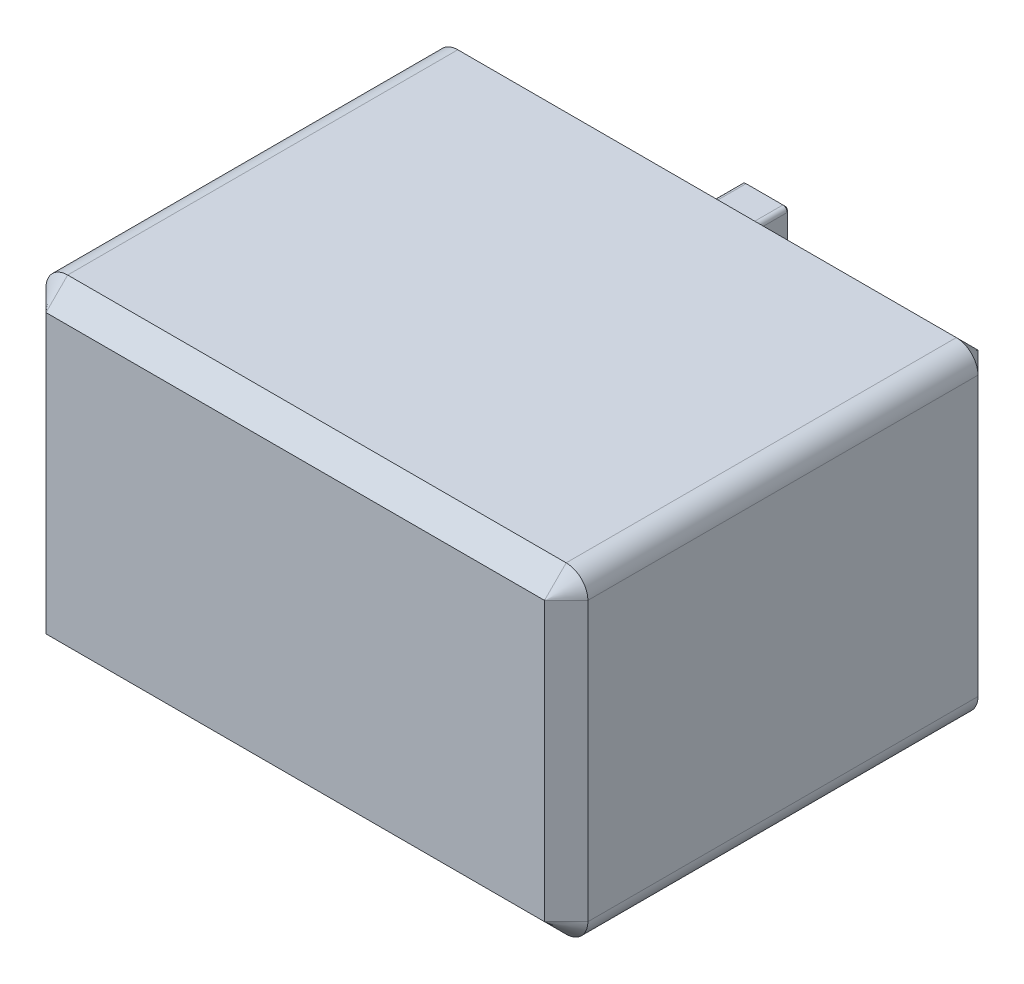
ISO-10303-21;
HEADER;
FILE_DESCRIPTION(('STEP AP214'),'2;1');
FILE_NAME('part.step','',(''),(''),'','','');
FILE_SCHEMA(('AUTOMOTIVE_DESIGN { 1 0 10303 214 1 1 1 1 }'));
ENDSEC;
DATA;
#1=APPLICATION_CONTEXT('core data for automotive mechanical design processes');
#2=APPLICATION_PROTOCOL_DEFINITION('international standard','automotive_design',2000,#1);
#3=PRODUCT_CONTEXT('',#1,'mechanical');
#4=PRODUCT('Part','Part','',(#3));
#5=PRODUCT_RELATED_PRODUCT_CATEGORY('part','',(#4));
#6=PRODUCT_DEFINITION_FORMATION('','',#4);
#7=PRODUCT_DEFINITION_CONTEXT('part definition',#1,'design');
#8=PRODUCT_DEFINITION('design','',#6,#7);
#9=PRODUCT_DEFINITION_SHAPE('','',#8);
#10=(LENGTH_UNIT() NAMED_UNIT(*) SI_UNIT(.MILLI.,.METRE.));
#11=(NAMED_UNIT(*) PLANE_ANGLE_UNIT() SI_UNIT($,.RADIAN.));
#12=(NAMED_UNIT(*) SI_UNIT($,.STERADIAN.) SOLID_ANGLE_UNIT());
#13=UNCERTAINTY_MEASURE_WITH_UNIT(LENGTH_MEASURE(1.E-05),#10,'distance_accuracy_value','');
#14=(GEOMETRIC_REPRESENTATION_CONTEXT(3) GLOBAL_UNCERTAINTY_ASSIGNED_CONTEXT((#13)) GLOBAL_UNIT_ASSIGNED_CONTEXT((#10,
#11,#12)) REPRESENTATION_CONTEXT('',''));
#15=CARTESIAN_POINT('',(0.,0.,0.));
#16=DIRECTION('',(0.,0.,1.));
#17=DIRECTION('',(1.,0.,0.));
#18=AXIS2_PLACEMENT_3D('',#15,#16,#17);
#19=CARTESIAN_POINT('',(0.,11.19,-5.2649655434629));
#20=DIRECTION('',(0.,1.,0.));
#21=DIRECTION('',(0.,0.,1.));
#22=AXIS2_PLACEMENT_3D('',#19,#20,#21);
#23=PLANE('',#22);
#24=DIRECTION('',(0.,0.,1.));
#25=VECTOR('',#24,1.);
#26=CARTESIAN_POINT('',(-0.85,11.19,-5.2649655434629));
#27=LINE('',#26,#25);
#28=CARTESIAN_POINT('',(-0.85,11.19,0.));
#29=VERTEX_POINT('',#28);
#30=CARTESIAN_POINT('',(-0.85,11.19,-1.64999999999999));
#31=VERTEX_POINT('',#30);
#32=EDGE_CURVE('E220',#29,#31,#27,.F.);
#33=ORIENTED_EDGE('',*,*,#32,.T.);
#34=DIRECTION('',(1.,0.,0.));
#35=VECTOR('',#34,1.);
#36=CARTESIAN_POINT('',(0.,11.19,-1.64999999999999));
#37=LINE('',#36,#35);
#38=CARTESIAN_POINT('',(0.85,11.19,-1.64999999999999));
#39=VERTEX_POINT('',#38);
#40=EDGE_CURVE('E216',#31,#39,#37,.T.);
#41=ORIENTED_EDGE('',*,*,#40,.T.);
#42=DIRECTION('',(0.,0.,1.));
#43=VECTOR('',#42,1.);
#44=CARTESIAN_POINT('',(0.85,11.19,0.));
#45=LINE('',#44,#43);
#46=CARTESIAN_POINT('',(0.85,11.19,0.));
#47=VERTEX_POINT('',#46);
#48=EDGE_CURVE('E209',#39,#47,#45,.T.);
#49=ORIENTED_EDGE('',*,*,#48,.T.);
#50=DIRECTION('',(-1.,0.,0.));
#51=VECTOR('',#50,1.);
#52=CARTESIAN_POINT('',(0.,11.19,0.));
#53=LINE('',#52,#51);
#54=EDGE_CURVE('E213',#47,#29,#53,.T.);
#55=ORIENTED_EDGE('',*,*,#54,.T.);
#56=EDGE_LOOP('',(#33,#41,#49,#55));
#57=FACE_BOUND('',#56,.T.);
#58=ADVANCED_FACE('F41',(#57),#23,.F.);
#59=CARTESIAN_POINT('',(1.05,0.,-5.2649655434629));
#60=DIRECTION('',(1.,0.,0.));
#61=DIRECTION('',(0.,1.,0.));
#62=AXIS2_PLACEMENT_3D('',#59,#60,#61);
#63=PLANE('',#62);
#64=DIRECTION('',(0.,0.,1.));
#65=VECTOR('',#64,1.);
#66=CARTESIAN_POINT('',(1.05,11.39,-1.75));
#67=LINE('',#66,#65);
#68=CARTESIAN_POINT('',(1.05,11.39,0.));
#69=VERTEX_POINT('',#68);
#70=CARTESIAN_POINT('',(1.05,11.39,-1.64999999999999));
#71=VERTEX_POINT('',#70);
#72=EDGE_CURVE('E226',#69,#71,#67,.F.);
#73=ORIENTED_EDGE('',*,*,#72,.T.);
#74=DIRECTION('',(0.,1.,0.));
#75=VECTOR('',#74,1.);
#76=CARTESIAN_POINT('',(1.05,13.49,-1.64999999999999));
#77=LINE('',#76,#75);
#78=CARTESIAN_POINT('',(1.05,13.49,-1.64999999999999));
#79=VERTEX_POINT('',#78);
#80=EDGE_CURVE('E321',#71,#79,#77,.T.);
#81=ORIENTED_EDGE('',*,*,#80,.T.);
#82=DIRECTION('',(0.,0.,1.));
#83=VECTOR('',#82,1.);
#84=CARTESIAN_POINT('',(1.05,13.49,-5.2649655434629));
#85=LINE('',#84,#83);
#86=CARTESIAN_POINT('',(1.05,13.49,0.));
#87=VERTEX_POINT('',#86);
#88=EDGE_CURVE('E219',#79,#87,#85,.T.);
#89=ORIENTED_EDGE('',*,*,#88,.T.);
#90=DIRECTION('',(0.,1.,0.));
#91=VECTOR('',#90,1.);
#92=CARTESIAN_POINT('',(1.05,0.,0.));
#93=LINE('',#92,#91);
#94=EDGE_CURVE('E237',#69,#87,#93,.T.);
#95=ORIENTED_EDGE('',*,*,#94,.F.);
#96=EDGE_LOOP('',(#73,#81,#89,#95));
#97=FACE_BOUND('',#96,.T.);
#98=ADVANCED_FACE('F530',(#97),#63,.T.);
#99=CARTESIAN_POINT('',(0.,13.69,-5.2649655434629));
#100=DIRECTION('',(0.,1.,0.));
#101=DIRECTION('',(0.,0.,1.));
#102=AXIS2_PLACEMENT_3D('',#99,#100,#101);
#103=PLANE('',#102);
#104=DIRECTION('',(0.,0.,1.));
#105=VECTOR('',#104,1.);
#106=CARTESIAN_POINT('',(0.85,13.69,-5.2649655434629));
#107=LINE('',#106,#105);
#108=CARTESIAN_POINT('',(0.85,13.69,0.));
#109=VERTEX_POINT('',#108);
#110=CARTESIAN_POINT('',(0.85,13.69,-1.64999999999999));
#111=VERTEX_POINT('',#110);
#112=EDGE_CURVE('E253',#109,#111,#107,.F.);
#113=ORIENTED_EDGE('',*,*,#112,.T.);
#114=DIRECTION('',(-1.,0.,0.));
#115=VECTOR('',#114,1.);
#116=CARTESIAN_POINT('',(-0.85,13.69,-1.64999999999999));
#117=LINE('',#116,#115);
#118=CARTESIAN_POINT('',(-0.85,13.69,-1.64999999999999));
#119=VERTEX_POINT('',#118);
#120=EDGE_CURVE('E310',#111,#119,#117,.T.);
#121=ORIENTED_EDGE('',*,*,#120,.T.);
#122=DIRECTION('',(0.,0.,1.));
#123=VECTOR('',#122,1.);
#124=CARTESIAN_POINT('',(-0.85,13.69,0.));
#125=LINE('',#124,#123);
#126=CARTESIAN_POINT('',(-0.85,13.69,0.));
#127=VERTEX_POINT('',#126);
#128=EDGE_CURVE('E251',#119,#127,#125,.T.);
#129=ORIENTED_EDGE('',*,*,#128,.T.);
#130=DIRECTION('',(-1.,0.,0.));
#131=VECTOR('',#130,1.);
#132=CARTESIAN_POINT('',(0.,13.69,0.));
#133=LINE('',#132,#131);
#134=EDGE_CURVE('E240',#109,#127,#133,.T.);
#135=ORIENTED_EDGE('',*,*,#134,.F.);
#136=EDGE_LOOP('',(#113,#121,#129,#135));
#137=FACE_BOUND('',#136,.T.);
#138=ADVANCED_FACE('F535',(#137),#103,.T.);
#139=CARTESIAN_POINT('',(-1.05,0.,-5.2649655434629));
#140=DIRECTION('',(1.,0.,0.));
#141=DIRECTION('',(0.,0.,-1.));
#142=AXIS2_PLACEMENT_3D('',#139,#140,#141);
#143=PLANE('',#142);
#144=DIRECTION('',(0.,0.,1.));
#145=VECTOR('',#144,1.);
#146=CARTESIAN_POINT('',(-1.05,13.49,-1.75));
#147=LINE('',#146,#145);
#148=CARTESIAN_POINT('',(-1.05,13.49,0.));
#149=VERTEX_POINT('',#148);
#150=CARTESIAN_POINT('',(-1.05,13.49,-1.64999999999999));
#151=VERTEX_POINT('',#150);
#152=EDGE_CURVE('E256',#149,#151,#147,.F.);
#153=ORIENTED_EDGE('',*,*,#152,.T.);
#154=DIRECTION('',(0.,-1.,0.));
#155=VECTOR('',#154,1.);
#156=CARTESIAN_POINT('',(-1.05,0.,-1.64999999999999));
#157=LINE('',#156,#155);
#158=CARTESIAN_POINT('',(-1.05,11.39,-1.64999999999999));
#159=VERTEX_POINT('',#158);
#160=EDGE_CURVE('E314',#151,#159,#157,.T.);
#161=ORIENTED_EDGE('',*,*,#160,.T.);
#162=DIRECTION('',(0.,0.,1.));
#163=VECTOR('',#162,1.);
#164=CARTESIAN_POINT('',(-1.05,11.39,-5.2649655434629));
#165=LINE('',#164,#163);
#166=CARTESIAN_POINT('',(-1.05,11.39,0.));
#167=VERTEX_POINT('',#166);
#168=EDGE_CURVE('E231',#159,#167,#165,.T.);
#169=ORIENTED_EDGE('',*,*,#168,.T.);
#170=DIRECTION('',(0.,1.,0.));
#171=VECTOR('',#170,1.);
#172=CARTESIAN_POINT('',(-1.05,0.,0.));
#173=LINE('',#172,#171);
#174=EDGE_CURVE('E238',#167,#149,#173,.T.);
#175=ORIENTED_EDGE('',*,*,#174,.T.);
#176=EDGE_LOOP('',(#153,#161,#169,#175));
#177=FACE_BOUND('',#176,.T.);
#178=ADVANCED_FACE('F540',(#177),#143,.F.);
#179=CARTESIAN_POINT('',(0.,0.,-1.75));
#180=DIRECTION('',(0.,0.,1.));
#181=DIRECTION('',(1.,0.,0.));
#182=AXIS2_PLACEMENT_3D('',#179,#180,#181);
#183=PLANE('',#182);
#184=DIRECTION('',(1.,0.,0.));
#185=VECTOR('',#184,1.);
#186=CARTESIAN_POINT('',(0.85,13.59,-1.75));
#187=LINE('',#186,#185);
#188=CARTESIAN_POINT('',(-0.85,13.59,-1.75));
#189=VERTEX_POINT('',#188);
#190=CARTESIAN_POINT('',(0.85,13.59,-1.75));
#191=VERTEX_POINT('',#190);
#192=EDGE_CURVE('E302',#189,#191,#187,.T.);
#193=ORIENTED_EDGE('',*,*,#192,.T.);
#194=CARTESIAN_POINT('',(0.85,13.49,-1.75));
#195=DIRECTION('',(0.,0.,1.));
#196=DIRECTION('',(1.,0.,0.));
#197=AXIS2_PLACEMENT_3D('',#194,#195,#196);
#198=CIRCLE('',#197,0.09999999999999);
#199=CARTESIAN_POINT('',(0.94999999999999,13.49,-1.75));
#200=VERTEX_POINT('',#199);
#201=EDGE_CURVE('E304',#191,#200,#198,.F.);
#202=ORIENTED_EDGE('',*,*,#201,.T.);
#203=DIRECTION('',(0.,-1.,0.));
#204=VECTOR('',#203,1.);
#205=CARTESIAN_POINT('',(0.94999999999999,11.39,-1.75));
#206=LINE('',#205,#204);
#207=CARTESIAN_POINT('',(0.94999999999999,11.39,-1.75));
#208=VERTEX_POINT('',#207);
#209=EDGE_CURVE('E290',#200,#208,#206,.T.);
#210=ORIENTED_EDGE('',*,*,#209,.T.);
#211=CARTESIAN_POINT('',(0.85,11.39,-1.75));
#212=DIRECTION('',(0.,0.,1.));
#213=DIRECTION('',(1.,0.,0.));
#214=AXIS2_PLACEMENT_3D('',#211,#212,#213);
#215=CIRCLE('',#214,0.0999999999999907);
#216=CARTESIAN_POINT('',(0.85,11.29,-1.75));
#217=VERTEX_POINT('',#216);
#218=EDGE_CURVE('E292',#208,#217,#215,.F.);
#219=ORIENTED_EDGE('',*,*,#218,.T.);
#220=DIRECTION('',(-1.,0.,0.));
#221=VECTOR('',#220,1.);
#222=CARTESIAN_POINT('',(0.,11.29,-1.75));
#223=LINE('',#222,#221);
#224=CARTESIAN_POINT('',(-0.85,11.29,-1.75));
#225=VERTEX_POINT('',#224);
#226=EDGE_CURVE('E294',#217,#225,#223,.T.);
#227=ORIENTED_EDGE('',*,*,#226,.T.);
#228=CARTESIAN_POINT('',(-0.85,11.39,-1.75));
#229=DIRECTION('',(0.,0.,1.));
#230=DIRECTION('',(1.,0.,0.));
#231=AXIS2_PLACEMENT_3D('',#228,#229,#230);
#232=CIRCLE('',#231,0.09999999999999);
#233=CARTESIAN_POINT('',(-0.94999999999999,11.39,-1.75));
#234=VERTEX_POINT('',#233);
#235=EDGE_CURVE('E296',#225,#234,#232,.F.);
#236=ORIENTED_EDGE('',*,*,#235,.T.);
#237=DIRECTION('',(0.,1.,0.));
#238=VECTOR('',#237,1.);
#239=CARTESIAN_POINT('',(-0.94999999999999,0.,-1.75));
#240=LINE('',#239,#238);
#241=CARTESIAN_POINT('',(-0.94999999999999,13.49,-1.75));
#242=VERTEX_POINT('',#241);
#243=EDGE_CURVE('E298',#234,#242,#240,.T.);
#244=ORIENTED_EDGE('',*,*,#243,.T.);
#245=CARTESIAN_POINT('',(-0.85,13.49,-1.75));
#246=DIRECTION('',(0.,0.,1.));
#247=DIRECTION('',(1.,0.,0.));
#248=AXIS2_PLACEMENT_3D('',#245,#246,#247);
#249=CIRCLE('',#248,0.0999999999999907);
#250=EDGE_CURVE('E300',#242,#189,#249,.F.);
#251=ORIENTED_EDGE('',*,*,#250,.T.);
#252=EDGE_LOOP('',(#193,#202,#210,#219,#227,#236,#244,#251));
#253=FACE_BOUND('',#252,.T.);
#254=ADVANCED_FACE('F542',(#253),#183,.F.);
#255=CARTESIAN_POINT('',(0.,0.,0.));
#256=DIRECTION('',(0.,0.,-1.));
#257=DIRECTION('',(-1.,0.,0.));
#258=AXIS2_PLACEMENT_3D('',#255,#256,#257);
#259=PLANE('',#258);
#260=DIRECTION('',(0.,1.,0.));
#261=VECTOR('',#260,1.);
#262=CARTESIAN_POINT('',(-11.5,0.,0.));
#263=LINE('',#262,#261);
#264=CARTESIAN_POINT('',(-11.5,1.20000000000001,0.));
#265=VERTEX_POINT('',#264);
#266=CARTESIAN_POINT('',(-11.5,14.04,0.));
#267=VERTEX_POINT('',#266);
#268=EDGE_CURVE('E65',#265,#267,#263,.T.);
#269=ORIENTED_EDGE('',*,*,#268,.T.);
#270=DIRECTION('',(1.,0.,0.));
#271=VECTOR('',#270,1.);
#272=CARTESIAN_POINT('',(11.5,14.04,0.));
#273=LINE('',#272,#271);
#274=CARTESIAN_POINT('',(11.5,14.04,0.));
#275=VERTEX_POINT('',#274);
#276=EDGE_CURVE('E12',#267,#275,#273,.T.);
#277=ORIENTED_EDGE('',*,*,#276,.T.);
#278=DIRECTION('',(0.,-1.,0.));
#279=VECTOR('',#278,1.);
#280=CARTESIAN_POINT('',(11.5,1.2,0.));
#281=LINE('',#280,#279);
#282=CARTESIAN_POINT('',(11.5,1.20000000000001,0.));
#283=VERTEX_POINT('',#282);
#284=EDGE_CURVE('E50',#275,#283,#281,.T.);
#285=ORIENTED_EDGE('',*,*,#284,.T.);
#286=DIRECTION('',(-1.,0.,0.));
#287=VECTOR('',#286,1.);
#288=CARTESIAN_POINT('',(0.,1.20000000000001,0.));
#289=LINE('',#288,#287);
#290=EDGE_CURVE('E394',#283,#265,#289,.T.);
#291=ORIENTED_EDGE('',*,*,#290,.T.);
#292=EDGE_LOOP('',(#269,#277,#285,#291));
#293=FACE_BOUND('',#292,.T.);
#294=ORIENTED_EDGE('',*,*,#54,.F.);
#295=CARTESIAN_POINT('',(0.85,11.39,0.));
#296=DIRECTION('',(0.,0.,-1.));
#297=DIRECTION('',(-1.,0.,0.));
#298=AXIS2_PLACEMENT_3D('',#295,#296,#297);
#299=CIRCLE('',#298,0.2);
#300=EDGE_CURVE('E223',#47,#69,#299,.F.);
#301=ORIENTED_EDGE('',*,*,#300,.T.);
#302=ORIENTED_EDGE('',*,*,#94,.T.);
#303=CARTESIAN_POINT('',(0.85,13.49,0.));
#304=DIRECTION('',(0.,0.,-1.));
#305=DIRECTION('',(-1.,0.,0.));
#306=AXIS2_PLACEMENT_3D('',#303,#304,#305);
#307=CIRCLE('',#306,0.2);
#308=EDGE_CURVE('E230',#87,#109,#307,.F.);
#309=ORIENTED_EDGE('',*,*,#308,.T.);
#310=ORIENTED_EDGE('',*,*,#134,.T.);
#311=CARTESIAN_POINT('',(-0.85,13.49,0.));
#312=DIRECTION('',(0.,0.,-1.));
#313=DIRECTION('',(-1.,0.,0.));
#314=AXIS2_PLACEMENT_3D('',#311,#312,#313);
#315=CIRCLE('',#314,0.2);
#316=EDGE_CURVE('E262',#127,#149,#315,.F.);
#317=ORIENTED_EDGE('',*,*,#316,.T.);
#318=ORIENTED_EDGE('',*,*,#174,.F.);
#319=CARTESIAN_POINT('',(-0.85,11.39,0.));
#320=DIRECTION('',(0.,0.,-1.));
#321=DIRECTION('',(-1.,0.,0.));
#322=AXIS2_PLACEMENT_3D('',#319,#320,#321);
#323=CIRCLE('',#322,0.2);
#324=EDGE_CURVE('E236',#167,#29,#323,.F.);
#325=ORIENTED_EDGE('',*,*,#324,.T.);
#326=EDGE_LOOP('',(#294,#301,#302,#309,#310,#317,#318,#325));
#327=FACE_BOUND('',#326,.T.);
#328=ADVANCED_FACE('F233',(#293,#327),#259,.T.);
#329=CARTESIAN_POINT('',(12.5,0.200000000000002,20.));
#330=DIRECTION('',(0.,-1.,0.));
#331=DIRECTION('',(0.,0.,-1.));
#332=AXIS2_PLACEMENT_3D('',#329,#330,#331);
#333=PLANE('',#332);
#334=DIRECTION('',(0.,0.,-1.));
#335=VECTOR('',#334,1.);
#336=CARTESIAN_POINT('',(11.5,0.200000000000002,20.));
#337=LINE('',#336,#335);
#338=CARTESIAN_POINT('',(11.5,0.200000000000002,1.00000000000001));
#339=VERTEX_POINT('',#338);
#340=CARTESIAN_POINT('',(11.5,0.200000000000002,19.));
#341=VERTEX_POINT('',#340);
#342=EDGE_CURVE('E274',#339,#341,#337,.F.);
#343=ORIENTED_EDGE('',*,*,#342,.T.);
#344=DIRECTION('',(-1.,0.,0.));
#345=VECTOR('',#344,1.);
#346=CARTESIAN_POINT('',(-11.5,0.200000000000002,19.));
#347=LINE('',#346,#345);
#348=CARTESIAN_POINT('',(-11.5,0.200000000000002,19.));
#349=VERTEX_POINT('',#348);
#350=EDGE_CURVE('E347',#341,#349,#347,.T.);
#351=ORIENTED_EDGE('',*,*,#350,.T.);
#352=DIRECTION('',(0.,0.,-1.));
#353=VECTOR('',#352,1.);
#354=CARTESIAN_POINT('',(-11.5,0.200000000000002,20.));
#355=LINE('',#354,#353);
#356=CARTESIAN_POINT('',(-11.5,0.200000000000002,1.00000000000001));
#357=VERTEX_POINT('',#356);
#358=EDGE_CURVE('E270',#349,#357,#355,.T.);
#359=ORIENTED_EDGE('',*,*,#358,.T.);
#360=DIRECTION('',(1.,0.,0.));
#361=VECTOR('',#360,1.);
#362=CARTESIAN_POINT('',(12.5,0.200000000000002,1.00000000000001));
#363=LINE('',#362,#361);
#364=EDGE_CURVE('E323',#357,#339,#363,.T.);
#365=ORIENTED_EDGE('',*,*,#364,.T.);
#366=EDGE_LOOP('',(#343,#351,#359,#365));
#367=FACE_BOUND('',#366,.T.);
#368=ADVANCED_FACE('F479',(#367),#333,.T.);
#369=CARTESIAN_POINT('',(12.5,0.200000000000002,20.));
#370=DIRECTION('',(-1.,0.,0.));
#371=DIRECTION('',(0.,0.,1.));
#372=AXIS2_PLACEMENT_3D('',#369,#370,#371);
#373=PLANE('',#372);
#374=DIRECTION('',(0.,0.,-1.));
#375=VECTOR('',#374,1.);
#376=CARTESIAN_POINT('',(12.5,14.04,20.));
#377=LINE('',#376,#375);
#378=CARTESIAN_POINT('',(12.5,14.04,1.00000000000001));
#379=VERTEX_POINT('',#378);
#380=CARTESIAN_POINT('',(12.5,14.04,19.));
#381=VERTEX_POINT('',#380);
#382=EDGE_CURVE('E264',#379,#381,#377,.F.);
#383=ORIENTED_EDGE('',*,*,#382,.T.);
#384=DIRECTION('',(0.,-1.,0.));
#385=VECTOR('',#384,1.);
#386=CARTESIAN_POINT('',(12.5,0.200000000000002,19.));
#387=LINE('',#386,#385);
#388=CARTESIAN_POINT('',(12.5,1.2,19.));
#389=VERTEX_POINT('',#388);
#390=EDGE_CURVE('E373',#381,#389,#387,.T.);
#391=ORIENTED_EDGE('',*,*,#390,.T.);
#392=DIRECTION('',(0.,0.,-1.));
#393=VECTOR('',#392,1.);
#394=CARTESIAN_POINT('',(12.5,1.2,0.));
#395=LINE('',#394,#393);
#396=CARTESIAN_POINT('',(12.5,1.2,1.00000000000001));
#397=VERTEX_POINT('',#396);
#398=EDGE_CURVE('E267',#389,#397,#395,.T.);
#399=ORIENTED_EDGE('',*,*,#398,.T.);
#400=DIRECTION('',(0.,1.,0.));
#401=VECTOR('',#400,1.);
#402=CARTESIAN_POINT('',(12.5,14.04,1.00000000000001));
#403=LINE('',#402,#401);
#404=EDGE_CURVE('E371',#397,#379,#403,.T.);
#405=ORIENTED_EDGE('',*,*,#404,.T.);
#406=EDGE_LOOP('',(#383,#391,#399,#405));
#407=FACE_BOUND('',#406,.T.);
#408=ADVANCED_FACE('F458',(#407),#373,.F.);
#409=CARTESIAN_POINT('',(12.5,15.04,20.));
#410=DIRECTION('',(0.,-1.,0.));
#411=DIRECTION('',(0.,0.,-1.));
#412=AXIS2_PLACEMENT_3D('',#409,#410,#411);
#413=PLANE('',#412);
#414=DIRECTION('',(0.,0.,-1.));
#415=VECTOR('',#414,1.);
#416=CARTESIAN_POINT('',(-11.5,15.04,20.));
#417=LINE('',#416,#415);
#418=CARTESIAN_POINT('',(-11.5,15.04,1.00000000000001));
#419=VERTEX_POINT('',#418);
#420=CARTESIAN_POINT('',(-11.5,15.04,19.));
#421=VERTEX_POINT('',#420);
#422=EDGE_CURVE('E277',#419,#421,#417,.F.);
#423=ORIENTED_EDGE('',*,*,#422,.T.);
#424=DIRECTION('',(1.,0.,0.));
#425=VECTOR('',#424,1.);
#426=CARTESIAN_POINT('',(12.5,15.04,19.));
#427=LINE('',#426,#425);
#428=CARTESIAN_POINT('',(11.5,15.04,19.));
#429=VERTEX_POINT('',#428);
#430=EDGE_CURVE('E392',#421,#429,#427,.T.);
#431=ORIENTED_EDGE('',*,*,#430,.T.);
#432=DIRECTION('',(0.,0.,-1.));
#433=VECTOR('',#432,1.);
#434=CARTESIAN_POINT('',(11.5,15.04,20.));
#435=LINE('',#434,#433);
#436=CARTESIAN_POINT('',(11.5,15.04,1.00000000000001));
#437=VERTEX_POINT('',#436);
#438=EDGE_CURVE('E280',#429,#437,#435,.T.);
#439=ORIENTED_EDGE('',*,*,#438,.T.);
#440=DIRECTION('',(-1.,0.,0.));
#441=VECTOR('',#440,1.);
#442=CARTESIAN_POINT('',(-11.5,15.04,1.00000000000001));
#443=LINE('',#442,#441);
#444=EDGE_CURVE('E389',#437,#419,#443,.T.);
#445=ORIENTED_EDGE('',*,*,#444,.T.);
#446=EDGE_LOOP('',(#423,#431,#439,#445));
#447=FACE_BOUND('',#446,.T.);
#448=ADVANCED_FACE('F513',(#447),#413,.F.);
#449=CARTESIAN_POINT('',(-12.5,0.200000000000002,20.));
#450=DIRECTION('',(-1.,0.,0.));
#451=DIRECTION('',(0.,0.,1.));
#452=AXIS2_PLACEMENT_3D('',#449,#450,#451);
#453=PLANE('',#452);
#454=DIRECTION('',(0.,0.,-1.));
#455=VECTOR('',#454,1.);
#456=CARTESIAN_POINT('',(-12.5,1.2,20.));
#457=LINE('',#456,#455);
#458=CARTESIAN_POINT('',(-12.5,1.2,1.00000000000001));
#459=VERTEX_POINT('',#458);
#460=CARTESIAN_POINT('',(-12.5,1.2,19.));
#461=VERTEX_POINT('',#460);
#462=EDGE_CURVE('E283',#459,#461,#457,.F.);
#463=ORIENTED_EDGE('',*,*,#462,.T.);
#464=DIRECTION('',(0.,1.,0.));
#465=VECTOR('',#464,1.);
#466=CARTESIAN_POINT('',(-12.5,14.04,19.));
#467=LINE('',#466,#465);
#468=CARTESIAN_POINT('',(-12.5,14.04,19.));
#469=VERTEX_POINT('',#468);
#470=EDGE_CURVE('E378',#461,#469,#467,.T.);
#471=ORIENTED_EDGE('',*,*,#470,.T.);
#472=DIRECTION('',(0.,0.,-1.));
#473=VECTOR('',#472,1.);
#474=CARTESIAN_POINT('',(-12.5,14.04,0.));
#475=LINE('',#474,#473);
#476=CARTESIAN_POINT('',(-12.5,14.04,1.00000000000001));
#477=VERTEX_POINT('',#476);
#478=EDGE_CURVE('E287',#469,#477,#475,.T.);
#479=ORIENTED_EDGE('',*,*,#478,.T.);
#480=DIRECTION('',(0.,-1.,0.));
#481=VECTOR('',#480,1.);
#482=CARTESIAN_POINT('',(-12.5,0.200000000000002,1.00000000000001));
#483=LINE('',#482,#481);
#484=EDGE_CURVE('E375',#477,#459,#483,.T.);
#485=ORIENTED_EDGE('',*,*,#484,.T.);
#486=EDGE_LOOP('',(#463,#471,#479,#485));
#487=FACE_BOUND('',#486,.T.);
#488=ADVANCED_FACE('F497',(#487),#453,.T.);
#489=CARTESIAN_POINT('',(0.,0.,20.));
#490=DIRECTION('',(0.,0.,-1.));
#491=DIRECTION('',(-1.,0.,0.));
#492=AXIS2_PLACEMENT_3D('',#489,#490,#491);
#493=PLANE('',#492);
#494=DIRECTION('',(0.,-1.,0.));
#495=VECTOR('',#494,1.);
#496=CARTESIAN_POINT('',(-11.5,1.2,20.));
#497=LINE('',#496,#495);
#498=CARTESIAN_POINT('',(-11.5,14.04,20.));
#499=VERTEX_POINT('',#498);
#500=CARTESIAN_POINT('',(-11.5,1.2,20.));
#501=VERTEX_POINT('',#500);
#502=EDGE_CURVE('E353',#499,#501,#497,.T.);
#503=ORIENTED_EDGE('',*,*,#502,.T.);
#504=DIRECTION('',(1.,0.,0.));
#505=VECTOR('',#504,1.);
#506=CARTESIAN_POINT('',(11.5,1.20000000000001,20.));
#507=LINE('',#506,#505);
#508=CARTESIAN_POINT('',(11.5,1.2,20.));
#509=VERTEX_POINT('',#508);
#510=EDGE_CURVE('E358',#501,#509,#507,.T.);
#511=ORIENTED_EDGE('',*,*,#510,.T.);
#512=DIRECTION('',(0.,1.,0.));
#513=VECTOR('',#512,1.);
#514=CARTESIAN_POINT('',(11.5,0.,20.));
#515=LINE('',#514,#513);
#516=CARTESIAN_POINT('',(11.5,14.04,20.));
#517=VERTEX_POINT('',#516);
#518=EDGE_CURVE('E356',#509,#517,#515,.T.);
#519=ORIENTED_EDGE('',*,*,#518,.T.);
#520=DIRECTION('',(-1.,0.,0.));
#521=VECTOR('',#520,1.);
#522=CARTESIAN_POINT('',(0.,14.04,20.));
#523=LINE('',#522,#521);
#524=EDGE_CURVE('E351',#517,#499,#523,.T.);
#525=ORIENTED_EDGE('',*,*,#524,.T.);
#526=EDGE_LOOP('',(#503,#511,#519,#525));
#527=FACE_BOUND('',#526,.T.);
#528=ADVANCED_FACE('F518',(#527),#493,.F.);
#529=CARTESIAN_POINT('',(0.85,11.39,-5.2649655434629));
#530=DIRECTION('',(0.,0.,-1.));
#531=DIRECTION('',(-1.,0.,0.));
#532=AXIS2_PLACEMENT_3D('',#529,#530,#531);
#533=CYLINDRICAL_SURFACE('',#532,0.2);
#534=ORIENTED_EDGE('',*,*,#48,.F.);
#535=CARTESIAN_POINT('',(0.85,11.39,-1.64999999999999));
#536=DIRECTION('',(0.,0.,1.));
#537=DIRECTION('',(1.,0.,0.));
#538=AXIS2_PLACEMENT_3D('',#535,#536,#537);
#539=CIRCLE('',#538,0.2);
#540=EDGE_CURVE('E319',#39,#71,#539,.T.);
#541=ORIENTED_EDGE('',*,*,#540,.T.);
#542=ORIENTED_EDGE('',*,*,#72,.F.);
#543=ORIENTED_EDGE('',*,*,#300,.F.);
#544=EDGE_LOOP('',(#534,#541,#542,#543));
#545=FACE_BOUND('',#544,.T.);
#546=ADVANCED_FACE('F224',(#545),#533,.T.);
#547=CARTESIAN_POINT('',(0.85,13.49,-5.2649655434629));
#548=DIRECTION('',(0.,0.,1.));
#549=DIRECTION('',(1.,0.,0.));
#550=AXIS2_PLACEMENT_3D('',#547,#548,#549);
#551=CYLINDRICAL_SURFACE('',#550,0.2);
#552=ORIENTED_EDGE('',*,*,#88,.F.);
#553=CARTESIAN_POINT('',(0.85,13.49,-1.64999999999999));
#554=DIRECTION('',(0.,0.,1.));
#555=DIRECTION('',(1.,0.,0.));
#556=AXIS2_PLACEMENT_3D('',#553,#554,#555);
#557=CIRCLE('',#556,0.2);
#558=EDGE_CURVE('E307',#79,#111,#557,.T.);
#559=ORIENTED_EDGE('',*,*,#558,.T.);
#560=ORIENTED_EDGE('',*,*,#112,.F.);
#561=ORIENTED_EDGE('',*,*,#308,.F.);
#562=EDGE_LOOP('',(#552,#559,#560,#561));
#563=FACE_BOUND('',#562,.T.);
#564=ADVANCED_FACE('F525',(#563),#551,.T.);
#565=CARTESIAN_POINT('',(-0.85,11.39,-5.2649655434629));
#566=DIRECTION('',(0.,0.,1.));
#567=DIRECTION('',(1.,0.,0.));
#568=AXIS2_PLACEMENT_3D('',#565,#566,#567);
#569=CYLINDRICAL_SURFACE('',#568,0.2);
#570=ORIENTED_EDGE('',*,*,#168,.F.);
#571=CARTESIAN_POINT('',(-0.85,11.39,-1.64999999999999));
#572=DIRECTION('',(0.,0.,1.));
#573=DIRECTION('',(1.,0.,0.));
#574=AXIS2_PLACEMENT_3D('',#571,#572,#573);
#575=CIRCLE('',#574,0.2);
#576=EDGE_CURVE('E316',#159,#31,#575,.T.);
#577=ORIENTED_EDGE('',*,*,#576,.T.);
#578=ORIENTED_EDGE('',*,*,#32,.F.);
#579=ORIENTED_EDGE('',*,*,#324,.F.);
#580=EDGE_LOOP('',(#570,#577,#578,#579));
#581=FACE_BOUND('',#580,.T.);
#582=ADVANCED_FACE('F547',(#581),#569,.T.);
#583=CARTESIAN_POINT('',(-0.85,13.49,-5.2649655434629));
#584=DIRECTION('',(0.,0.,-1.));
#585=DIRECTION('',(-1.,0.,0.));
#586=AXIS2_PLACEMENT_3D('',#583,#584,#585);
#587=CYLINDRICAL_SURFACE('',#586,0.2);
#588=ORIENTED_EDGE('',*,*,#128,.F.);
#589=CARTESIAN_POINT('',(-0.85,13.49,-1.64999999999999));
#590=DIRECTION('',(0.,0.,1.));
#591=DIRECTION('',(1.,0.,0.));
#592=AXIS2_PLACEMENT_3D('',#589,#590,#591);
#593=CIRCLE('',#592,0.2);
#594=EDGE_CURVE('E312',#119,#151,#593,.T.);
#595=ORIENTED_EDGE('',*,*,#594,.T.);
#596=ORIENTED_EDGE('',*,*,#152,.F.);
#597=ORIENTED_EDGE('',*,*,#316,.F.);
#598=EDGE_LOOP('',(#588,#595,#596,#597));
#599=FACE_BOUND('',#598,.T.);
#600=ADVANCED_FACE('F551',(#599),#587,.T.);
#601=CARTESIAN_POINT('',(11.5,1.2,20.));
#602=DIRECTION('',(0.,0.,1.));
#603=DIRECTION('',(1.,0.,0.));
#604=AXIS2_PLACEMENT_3D('',#601,#602,#603);
#605=CYLINDRICAL_SURFACE('',#604,1.);
#606=ORIENTED_EDGE('',*,*,#398,.F.);
#607=CARTESIAN_POINT('',(11.5,1.2,19.));
#608=DIRECTION('',(0.,0.,-1.));
#609=DIRECTION('',(-1.,0.,0.));
#610=AXIS2_PLACEMENT_3D('',#607,#608,#609);
#611=CIRCLE('',#610,1.);
#612=EDGE_CURVE('E364',#389,#341,#611,.T.);
#613=ORIENTED_EDGE('',*,*,#612,.T.);
#614=ORIENTED_EDGE('',*,*,#342,.F.);
#615=CARTESIAN_POINT('',(11.5,1.2,1.00000000000001));
#616=DIRECTION('',(0.,0.,-1.));
#617=DIRECTION('',(-1.,0.,0.));
#618=AXIS2_PLACEMENT_3D('',#615,#616,#617);
#619=CIRCLE('',#618,1.);
#620=EDGE_CURVE('E362',#339,#397,#619,.F.);
#621=ORIENTED_EDGE('',*,*,#620,.T.);
#622=EDGE_LOOP('',(#606,#613,#614,#621));
#623=FACE_BOUND('',#622,.T.);
#624=ADVANCED_FACE('F475',(#623),#605,.T.);
#625=CARTESIAN_POINT('',(11.5,14.04,20.));
#626=DIRECTION('',(0.,0.,-1.));
#627=DIRECTION('',(-1.,0.,0.));
#628=AXIS2_PLACEMENT_3D('',#625,#626,#627);
#629=CYLINDRICAL_SURFACE('',#628,1.);
#630=ORIENTED_EDGE('',*,*,#438,.F.);
#631=CARTESIAN_POINT('',(11.5,14.04,19.));
#632=DIRECTION('',(0.,0.,-1.));
#633=DIRECTION('',(-1.,0.,0.));
#634=AXIS2_PLACEMENT_3D('',#631,#632,#633);
#635=CIRCLE('',#634,1.);
#636=EDGE_CURVE('E383',#429,#381,#635,.T.);
#637=ORIENTED_EDGE('',*,*,#636,.T.);
#638=ORIENTED_EDGE('',*,*,#382,.F.);
#639=CARTESIAN_POINT('',(11.5,14.04,1.00000000000001));
#640=DIRECTION('',(0.,0.,-1.));
#641=DIRECTION('',(-1.,0.,0.));
#642=AXIS2_PLACEMENT_3D('',#639,#640,#641);
#643=CIRCLE('',#642,1.);
#644=EDGE_CURVE('E381',#379,#437,#643,.F.);
#645=ORIENTED_EDGE('',*,*,#644,.T.);
#646=EDGE_LOOP('',(#630,#637,#638,#645));
#647=FACE_BOUND('',#646,.T.);
#648=ADVANCED_FACE('F463',(#647),#629,.T.);
#649=CARTESIAN_POINT('',(-11.5,14.04,20.));
#650=DIRECTION('',(0.,0.,1.));
#651=DIRECTION('',(1.,0.,0.));
#652=AXIS2_PLACEMENT_3D('',#649,#650,#651);
#653=CYLINDRICAL_SURFACE('',#652,1.);
#654=ORIENTED_EDGE('',*,*,#478,.F.);
#655=CARTESIAN_POINT('',(-11.5,14.04,19.));
#656=DIRECTION('',(0.,0.,-1.));
#657=DIRECTION('',(-1.,0.,0.));
#658=AXIS2_PLACEMENT_3D('',#655,#656,#657);
#659=CIRCLE('',#658,1.);
#660=EDGE_CURVE('E387',#469,#421,#659,.T.);
#661=ORIENTED_EDGE('',*,*,#660,.T.);
#662=ORIENTED_EDGE('',*,*,#422,.F.);
#663=CARTESIAN_POINT('',(-11.5,14.04,1.00000000000001));
#664=DIRECTION('',(0.,0.,-1.));
#665=DIRECTION('',(-1.,0.,0.));
#666=AXIS2_PLACEMENT_3D('',#663,#664,#665);
#667=CIRCLE('',#666,1.);
#668=EDGE_CURVE('E385',#419,#477,#667,.F.);
#669=ORIENTED_EDGE('',*,*,#668,.T.);
#670=EDGE_LOOP('',(#654,#661,#662,#669));
#671=FACE_BOUND('',#670,.T.);
#672=ADVANCED_FACE('F510',(#671),#653,.T.);
#673=CARTESIAN_POINT('',(-11.5,1.2,20.));
#674=DIRECTION('',(0.,0.,-1.));
#675=DIRECTION('',(-1.,0.,0.));
#676=AXIS2_PLACEMENT_3D('',#673,#674,#675);
#677=CYLINDRICAL_SURFACE('',#676,1.);
#678=ORIENTED_EDGE('',*,*,#358,.F.);
#679=CARTESIAN_POINT('',(-11.5,1.2,19.));
#680=DIRECTION('',(0.,0.,-1.));
#681=DIRECTION('',(-1.,0.,0.));
#682=AXIS2_PLACEMENT_3D('',#679,#680,#681);
#683=CIRCLE('',#682,1.);
#684=EDGE_CURVE('E368',#349,#461,#683,.T.);
#685=ORIENTED_EDGE('',*,*,#684,.T.);
#686=ORIENTED_EDGE('',*,*,#462,.F.);
#687=CARTESIAN_POINT('',(-11.5,1.2,1.00000000000001));
#688=DIRECTION('',(0.,0.,-1.));
#689=DIRECTION('',(-1.,0.,0.));
#690=AXIS2_PLACEMENT_3D('',#687,#688,#689);
#691=CIRCLE('',#690,1.);
#692=EDGE_CURVE('E366',#459,#357,#691,.F.);
#693=ORIENTED_EDGE('',*,*,#692,.T.);
#694=EDGE_LOOP('',(#678,#685,#686,#693));
#695=FACE_BOUND('',#694,.T.);
#696=ADVANCED_FACE('F494',(#695),#677,.T.);
#697=CARTESIAN_POINT('',(-0.85,11.39,-1.75));
#698=DIRECTION('',(0.,0.,1.));
#699=DIRECTION('',(1.,0.,0.));
#700=AXIS2_PLACEMENT_3D('',#697,#698,#699);
#701=CONICAL_SURFACE('',#700,0.0999999999999902,0.785398163397466);
#702=DIRECTION('',(0.,0.707106781186559,-0.707106781186536));
#703=VECTOR('',#702,1.);
#704=CARTESIAN_POINT('',(-0.85,11.19,-1.64999999999999));
#705=LINE('',#704,#703);
#706=EDGE_CURVE('E341',#31,#225,#705,.T.);
#707=ORIENTED_EDGE('',*,*,#706,.F.);
#708=ORIENTED_EDGE('',*,*,#576,.F.);
#709=DIRECTION('',(-0.70710678118656,0.,0.707106781186535));
#710=VECTOR('',#709,1.);
#711=CARTESIAN_POINT('',(-0.94999999999999,11.39,-1.75));
#712=LINE('',#711,#710);
#713=EDGE_CURVE('E243',#234,#159,#712,.T.);
#714=ORIENTED_EDGE('',*,*,#713,.F.);
#715=ORIENTED_EDGE('',*,*,#235,.F.);
#716=EDGE_LOOP('',(#707,#708,#714,#715));
#717=FACE_BOUND('',#716,.T.);
#718=ADVANCED_FACE('F564',(#717),#701,.T.);
#719=CARTESIAN_POINT('',(-1.05,0.,-1.64999999999999));
#720=DIRECTION('',(0.707106781186536,0.,0.707106781186559));
#721=DIRECTION('',(0.,-1.,0.));
#722=AXIS2_PLACEMENT_3D('',#719,#720,#721);
#723=PLANE('',#722);
#724=ORIENTED_EDGE('',*,*,#713,.T.);
#725=ORIENTED_EDGE('',*,*,#160,.F.);
#726=DIRECTION('',(-0.707106781186559,0.,0.707106781186536));
#727=VECTOR('',#726,1.);
#728=CARTESIAN_POINT('',(-0.94999999999999,13.49,-1.75));
#729=LINE('',#728,#727);
#730=EDGE_CURVE('E338',#242,#151,#729,.T.);
#731=ORIENTED_EDGE('',*,*,#730,.F.);
#732=ORIENTED_EDGE('',*,*,#243,.F.);
#733=EDGE_LOOP('',(#724,#725,#731,#732));
#734=FACE_BOUND('',#733,.T.);
#735=ADVANCED_FACE('F588',(#734),#723,.F.);
#736=CARTESIAN_POINT('',(0.,11.19,-1.64999999999999));
#737=DIRECTION('',(0.,0.707106781186536,0.707106781186559));
#738=DIRECTION('',(1.,0.,0.));
#739=AXIS2_PLACEMENT_3D('',#736,#737,#738);
#740=PLANE('',#739);
#741=ORIENTED_EDGE('',*,*,#706,.T.);
#742=ORIENTED_EDGE('',*,*,#226,.F.);
#743=DIRECTION('',(0.,0.707106781186559,-0.707106781186536));
#744=VECTOR('',#743,1.);
#745=CARTESIAN_POINT('',(0.85,11.19,-1.64999999999999));
#746=LINE('',#745,#744);
#747=EDGE_CURVE('E335',#39,#217,#746,.T.);
#748=ORIENTED_EDGE('',*,*,#747,.F.);
#749=ORIENTED_EDGE('',*,*,#40,.F.);
#750=EDGE_LOOP('',(#741,#742,#748,#749));
#751=FACE_BOUND('',#750,.T.);
#752=ADVANCED_FACE('F584',(#751),#740,.F.);
#753=CARTESIAN_POINT('',(-0.85,13.49,-1.75));
#754=DIRECTION('',(0.,0.,1.));
#755=DIRECTION('',(1.,0.,0.));
#756=AXIS2_PLACEMENT_3D('',#753,#754,#755);
#757=CONICAL_SURFACE('',#756,0.0999999999999907,0.785398163397463);
#758=ORIENTED_EDGE('',*,*,#730,.T.);
#759=ORIENTED_EDGE('',*,*,#594,.F.);
#760=DIRECTION('',(0.,0.707106781186559,0.707106781186536));
#761=VECTOR('',#760,1.);
#762=CARTESIAN_POINT('',(-0.85,13.59,-1.75));
#763=LINE('',#762,#761);
#764=EDGE_CURVE('E332',#189,#119,#763,.T.);
#765=ORIENTED_EDGE('',*,*,#764,.F.);
#766=ORIENTED_EDGE('',*,*,#250,.F.);
#767=EDGE_LOOP('',(#758,#759,#765,#766));
#768=FACE_BOUND('',#767,.T.);
#769=ADVANCED_FACE('F580',(#768),#757,.T.);
#770=CARTESIAN_POINT('',(0.85,11.39,-1.75));
#771=DIRECTION('',(0.,0.,1.));
#772=DIRECTION('',(1.,0.,0.));
#773=AXIS2_PLACEMENT_3D('',#770,#771,#772);
#774=CONICAL_SURFACE('',#773,0.0999999999999907,0.785398163397463);
#775=ORIENTED_EDGE('',*,*,#747,.T.);
#776=ORIENTED_EDGE('',*,*,#218,.F.);
#777=DIRECTION('',(-0.707106781186558,0.,-0.707106781186538));
#778=VECTOR('',#777,1.);
#779=CARTESIAN_POINT('',(1.05,11.39,-1.64999999999999));
#780=LINE('',#779,#778);
#781=EDGE_CURVE('E329',#71,#208,#780,.T.);
#782=ORIENTED_EDGE('',*,*,#781,.F.);
#783=ORIENTED_EDGE('',*,*,#540,.F.);
#784=EDGE_LOOP('',(#775,#776,#782,#783));
#785=FACE_BOUND('',#784,.T.);
#786=ADVANCED_FACE('F576',(#785),#774,.T.);
#787=CARTESIAN_POINT('',(0.,13.59,-1.75));
#788=DIRECTION('',(0.,0.707106781186536,-0.707106781186559));
#789=DIRECTION('',(-1.,0.,0.));
#790=AXIS2_PLACEMENT_3D('',#787,#788,#789);
#791=PLANE('',#790);
#792=ORIENTED_EDGE('',*,*,#764,.T.);
#793=ORIENTED_EDGE('',*,*,#120,.F.);
#794=DIRECTION('',(0.,0.707106781186559,0.707106781186536));
#795=VECTOR('',#794,1.);
#796=CARTESIAN_POINT('',(0.85,13.59,-1.75));
#797=LINE('',#796,#795);
#798=EDGE_CURVE('E326',#191,#111,#797,.T.);
#799=ORIENTED_EDGE('',*,*,#798,.F.);
#800=ORIENTED_EDGE('',*,*,#192,.F.);
#801=EDGE_LOOP('',(#792,#793,#799,#800));
#802=FACE_BOUND('',#801,.T.);
#803=ADVANCED_FACE('F572',(#802),#791,.T.);
#804=CARTESIAN_POINT('',(0.949999999999991,0.,-1.75));
#805=DIRECTION('',(0.707106781186536,0.,-0.707106781186559));
#806=DIRECTION('',(0.,1.,0.));
#807=AXIS2_PLACEMENT_3D('',#804,#805,#806);
#808=PLANE('',#807);
#809=ORIENTED_EDGE('',*,*,#781,.T.);
#810=ORIENTED_EDGE('',*,*,#209,.F.);
#811=DIRECTION('',(-0.707106781186559,0.,-0.707106781186536));
#812=VECTOR('',#811,1.);
#813=CARTESIAN_POINT('',(1.05,13.49,-1.64999999999999));
#814=LINE('',#813,#812);
#815=EDGE_CURVE('E324',#79,#200,#814,.T.);
#816=ORIENTED_EDGE('',*,*,#815,.F.);
#817=ORIENTED_EDGE('',*,*,#80,.F.);
#818=EDGE_LOOP('',(#809,#810,#816,#817));
#819=FACE_BOUND('',#818,.T.);
#820=ADVANCED_FACE('F568',(#819),#808,.T.);
#821=CARTESIAN_POINT('',(0.85,13.49,-1.75));
#822=DIRECTION('',(0.,0.,1.));
#823=DIRECTION('',(1.,0.,0.));
#824=AXIS2_PLACEMENT_3D('',#821,#822,#823);
#825=CONICAL_SURFACE('',#824,0.0999999999999902,0.785398163397466);
#826=ORIENTED_EDGE('',*,*,#798,.T.);
#827=ORIENTED_EDGE('',*,*,#558,.F.);
#828=ORIENTED_EDGE('',*,*,#815,.T.);
#829=ORIENTED_EDGE('',*,*,#201,.F.);
#830=EDGE_LOOP('',(#826,#827,#828,#829));
#831=FACE_BOUND('',#830,.T.);
#832=ADVANCED_FACE('F565',(#831),#825,.T.);
#833=CARTESIAN_POINT('',(0.,14.04,20.));
#834=DIRECTION('',(0.,-0.70710678118655,-0.707106781186545));
#835=DIRECTION('',(-1.,0.,0.));
#836=AXIS2_PLACEMENT_3D('',#833,#834,#835);
#837=PLANE('',#836);
#838=DIRECTION('',(0.,-0.707106781186545,0.70710678118655));
#839=VECTOR('',#838,1.);
#840=CARTESIAN_POINT('',(11.5,15.04,19.));
#841=LINE('',#840,#839);
#842=EDGE_CURVE('E327',#429,#517,#841,.T.);
#843=ORIENTED_EDGE('',*,*,#842,.F.);
#844=ORIENTED_EDGE('',*,*,#430,.F.);
#845=DIRECTION('',(0.,0.707106781186545,-0.70710678118655));
#846=VECTOR('',#845,1.);
#847=CARTESIAN_POINT('',(-11.5,14.04,20.));
#848=LINE('',#847,#846);
#849=EDGE_CURVE('E417',#499,#421,#848,.T.);
#850=ORIENTED_EDGE('',*,*,#849,.F.);
#851=ORIENTED_EDGE('',*,*,#524,.F.);
#852=EDGE_LOOP('',(#843,#844,#850,#851));
#853=FACE_BOUND('',#852,.T.);
#854=ADVANCED_FACE('F515',(#853),#837,.F.);
#855=CARTESIAN_POINT('',(11.5,14.04,19.));
#856=DIRECTION('',(0.,0.,-1.));
#857=DIRECTION('',(-1.,0.,0.));
#858=AXIS2_PLACEMENT_3D('',#855,#856,#857);
#859=CONICAL_SURFACE('',#858,1.,0.785398163397445);
#860=ORIENTED_EDGE('',*,*,#636,.F.);
#861=ORIENTED_EDGE('',*,*,#842,.T.);
#862=DIRECTION('',(-0.707106781186545,0.,0.70710678118655));
#863=VECTOR('',#862,1.);
#864=CARTESIAN_POINT('',(12.5,14.04,19.));
#865=LINE('',#864,#863);
#866=EDGE_CURVE('E414',#381,#517,#865,.T.);
#867=ORIENTED_EDGE('',*,*,#866,.F.);
#868=EDGE_LOOP('',(#860,#861,#867));
#869=FACE_BOUND('',#868,.T.);
#870=ADVANCED_FACE('F467',(#869),#859,.T.);
#871=CARTESIAN_POINT('',(-11.5,14.04,19.));
#872=DIRECTION('',(0.,0.,-1.));
#873=DIRECTION('',(-1.,0.,0.));
#874=AXIS2_PLACEMENT_3D('',#871,#872,#873);
#875=CONICAL_SURFACE('',#874,1.,0.785398163397445);
#876=ORIENTED_EDGE('',*,*,#849,.T.);
#877=ORIENTED_EDGE('',*,*,#660,.F.);
#878=DIRECTION('',(-0.707106781186545,0.,-0.70710678118655));
#879=VECTOR('',#878,1.);
#880=CARTESIAN_POINT('',(-11.5,14.04,20.));
#881=LINE('',#880,#879);
#882=EDGE_CURVE('E411',#499,#469,#881,.T.);
#883=ORIENTED_EDGE('',*,*,#882,.F.);
#884=EDGE_LOOP('',(#876,#877,#883));
#885=FACE_BOUND('',#884,.T.);
#886=ADVANCED_FACE('F506',(#885),#875,.T.);
#887=CARTESIAN_POINT('',(11.5,0.,20.));
#888=DIRECTION('',(-0.70710678118655,0.,-0.707106781186545));
#889=DIRECTION('',(0.,1.,0.));
#890=AXIS2_PLACEMENT_3D('',#887,#888,#889);
#891=PLANE('',#890);
#892=ORIENTED_EDGE('',*,*,#866,.T.);
#893=ORIENTED_EDGE('',*,*,#518,.F.);
#894=DIRECTION('',(-0.707106781186545,0.,0.70710678118655));
#895=VECTOR('',#894,1.);
#896=CARTESIAN_POINT('',(12.5,1.2,19.));
#897=LINE('',#896,#895);
#898=EDGE_CURVE('E408',#389,#509,#897,.T.);
#899=ORIENTED_EDGE('',*,*,#898,.F.);
#900=ORIENTED_EDGE('',*,*,#390,.F.);
#901=EDGE_LOOP('',(#892,#893,#899,#900));
#902=FACE_BOUND('',#901,.T.);
#903=ADVANCED_FACE('F472',(#902),#891,.F.);
#904=CARTESIAN_POINT('',(-12.5,0.200000000000002,19.));
#905=DIRECTION('',(-0.70710678118655,0.,0.707106781186545));
#906=DIRECTION('',(0.,-1.,0.));
#907=AXIS2_PLACEMENT_3D('',#904,#905,#906);
#908=PLANE('',#907);
#909=ORIENTED_EDGE('',*,*,#882,.T.);
#910=ORIENTED_EDGE('',*,*,#470,.F.);
#911=DIRECTION('',(-0.707106781186545,0.,-0.70710678118655));
#912=VECTOR('',#911,1.);
#913=CARTESIAN_POINT('',(-11.5,1.2,20.));
#914=LINE('',#913,#912);
#915=EDGE_CURVE('E404',#501,#461,#914,.T.);
#916=ORIENTED_EDGE('',*,*,#915,.F.);
#917=ORIENTED_EDGE('',*,*,#502,.F.);
#918=EDGE_LOOP('',(#909,#910,#916,#917));
#919=FACE_BOUND('',#918,.T.);
#920=ADVANCED_FACE('F501',(#919),#908,.T.);
#921=CARTESIAN_POINT('',(11.5,1.2,19.));
#922=DIRECTION('',(0.,0.,-1.));
#923=DIRECTION('',(-1.,0.,0.));
#924=AXIS2_PLACEMENT_3D('',#921,#922,#923);
#925=CONICAL_SURFACE('',#924,1.,0.785398163397445);
#926=ORIENTED_EDGE('',*,*,#612,.F.);
#927=ORIENTED_EDGE('',*,*,#898,.T.);
#928=DIRECTION('',(0.,0.707106781186545,0.70710678118655));
#929=VECTOR('',#928,1.);
#930=CARTESIAN_POINT('',(11.5,0.200000000000002,19.));
#931=LINE('',#930,#929);
#932=EDGE_CURVE('E402',#341,#509,#931,.T.);
#933=ORIENTED_EDGE('',*,*,#932,.F.);
#934=EDGE_LOOP('',(#926,#927,#933));
#935=FACE_BOUND('',#934,.T.);
#936=ADVANCED_FACE('F483',(#935),#925,.T.);
#937=CARTESIAN_POINT('',(-11.5,1.2,19.));
#938=DIRECTION('',(0.,0.,-1.));
#939=DIRECTION('',(-1.,0.,0.));
#940=AXIS2_PLACEMENT_3D('',#937,#938,#939);
#941=CONICAL_SURFACE('',#940,1.,0.785398163397445);
#942=ORIENTED_EDGE('',*,*,#915,.T.);
#943=ORIENTED_EDGE('',*,*,#684,.F.);
#944=DIRECTION('',(0.,-0.707106781186545,-0.70710678118655));
#945=VECTOR('',#944,1.);
#946=CARTESIAN_POINT('',(-11.5,1.20000000000001,20.));
#947=LINE('',#946,#945);
#948=EDGE_CURVE('E399',#501,#349,#947,.T.);
#949=ORIENTED_EDGE('',*,*,#948,.F.);
#950=EDGE_LOOP('',(#942,#943,#949));
#951=FACE_BOUND('',#950,.T.);
#952=ADVANCED_FACE('F490',(#951),#941,.T.);
#953=CARTESIAN_POINT('',(12.5,0.200000000000002,19.));
#954=DIRECTION('',(0.,-0.70710678118655,0.707106781186545));
#955=DIRECTION('',(1.,0.,0.));
#956=AXIS2_PLACEMENT_3D('',#953,#954,#955);
#957=PLANE('',#956);
#958=ORIENTED_EDGE('',*,*,#932,.T.);
#959=ORIENTED_EDGE('',*,*,#510,.F.);
#960=ORIENTED_EDGE('',*,*,#948,.T.);
#961=ORIENTED_EDGE('',*,*,#350,.F.);
#962=EDGE_LOOP('',(#958,#959,#960,#961));
#963=FACE_BOUND('',#962,.T.);
#964=ADVANCED_FACE('F486',(#963),#957,.T.);
#965=CARTESIAN_POINT('',(0.,1.20000000000001,0.));
#966=DIRECTION('',(0.,0.70710678118655,0.707106781186545));
#967=DIRECTION('',(-1.,0.,0.));
#968=AXIS2_PLACEMENT_3D('',#965,#966,#967);
#969=PLANE('',#968);
#970=DIRECTION('',(0.,0.707106781186545,-0.70710678118655));
#971=VECTOR('',#970,1.);
#972=CARTESIAN_POINT('',(11.5,0.200000000000002,1.00000000000001));
#973=LINE('',#972,#971);
#974=EDGE_CURVE('E45',#339,#283,#973,.T.);
#975=ORIENTED_EDGE('',*,*,#974,.F.);
#976=ORIENTED_EDGE('',*,*,#364,.F.);
#977=DIRECTION('',(0.,-0.707106781186545,0.70710678118655));
#978=VECTOR('',#977,1.);
#979=CARTESIAN_POINT('',(-11.5,1.20000000000001,0.));
#980=LINE('',#979,#978);
#981=EDGE_CURVE('E435',#265,#357,#980,.T.);
#982=ORIENTED_EDGE('',*,*,#981,.F.);
#983=ORIENTED_EDGE('',*,*,#290,.F.);
#984=EDGE_LOOP('',(#975,#976,#982,#983));
#985=FACE_BOUND('',#984,.T.);
#986=ADVANCED_FACE('F43',(#985),#969,.F.);
#987=CARTESIAN_POINT('',(11.5,1.2,1.00000000000001));
#988=DIRECTION('',(0.,0.,1.));
#989=DIRECTION('',(1.,0.,0.));
#990=AXIS2_PLACEMENT_3D('',#987,#988,#989);
#991=CONICAL_SURFACE('',#990,1.,0.785398163397445);
#992=ORIENTED_EDGE('',*,*,#620,.F.);
#993=ORIENTED_EDGE('',*,*,#974,.T.);
#994=DIRECTION('',(-0.707106781186545,0.,-0.70710678118655));
#995=VECTOR('',#994,1.);
#996=CARTESIAN_POINT('',(12.5,1.2,1.00000000000001));
#997=LINE('',#996,#995);
#998=EDGE_CURVE('E433',#397,#283,#997,.T.);
#999=ORIENTED_EDGE('',*,*,#998,.F.);
#1000=EDGE_LOOP('',(#992,#993,#999));
#1001=FACE_BOUND('',#1000,.T.);
#1002=ADVANCED_FACE('F446',(#1001),#991,.T.);
#1003=CARTESIAN_POINT('',(-11.5,1.2,1.00000000000001));
#1004=DIRECTION('',(0.,0.,1.));
#1005=DIRECTION('',(1.,0.,0.));
#1006=AXIS2_PLACEMENT_3D('',#1003,#1004,#1005);
#1007=CONICAL_SURFACE('',#1006,1.,0.785398163397445);
#1008=ORIENTED_EDGE('',*,*,#981,.T.);
#1009=ORIENTED_EDGE('',*,*,#692,.F.);
#1010=DIRECTION('',(-0.707106781186544,0.,0.707106781186551));
#1011=VECTOR('',#1010,1.);
#1012=CARTESIAN_POINT('',(-11.5,1.2,0.));
#1013=LINE('',#1012,#1011);
#1014=EDGE_CURVE('E430',#265,#459,#1013,.T.);
#1015=ORIENTED_EDGE('',*,*,#1014,.F.);
#1016=EDGE_LOOP('',(#1008,#1009,#1015));
#1017=FACE_BOUND('',#1016,.T.);
#1018=ADVANCED_FACE('F629',(#1017),#1007,.T.);
#1019=CARTESIAN_POINT('',(12.5,0.200000000000002,1.00000000000001));
#1020=DIRECTION('',(0.70710678118655,0.,-0.707106781186545));
#1021=DIRECTION('',(0.,-1.,0.));
#1022=AXIS2_PLACEMENT_3D('',#1019,#1020,#1021);
#1023=PLANE('',#1022);
#1024=ORIENTED_EDGE('',*,*,#998,.T.);
#1025=ORIENTED_EDGE('',*,*,#284,.F.);
#1026=DIRECTION('',(-0.707106781186545,0.,-0.70710678118655));
#1027=VECTOR('',#1026,1.);
#1028=CARTESIAN_POINT('',(12.5,14.04,1.00000000000001));
#1029=LINE('',#1028,#1027);
#1030=EDGE_CURVE('E428',#379,#275,#1029,.T.);
#1031=ORIENTED_EDGE('',*,*,#1030,.F.);
#1032=ORIENTED_EDGE('',*,*,#404,.F.);
#1033=EDGE_LOOP('',(#1024,#1025,#1031,#1032));
#1034=FACE_BOUND('',#1033,.T.);
#1035=ADVANCED_FACE('F453',(#1034),#1023,.T.);
#1036=CARTESIAN_POINT('',(-11.5,0.,0.));
#1037=DIRECTION('',(0.70710678118655,0.,0.707106781186545));
#1038=DIRECTION('',(0.,1.,0.));
#1039=AXIS2_PLACEMENT_3D('',#1036,#1037,#1038);
#1040=PLANE('',#1039);
#1041=ORIENTED_EDGE('',*,*,#1014,.T.);
#1042=ORIENTED_EDGE('',*,*,#484,.F.);
#1043=DIRECTION('',(-0.707106781186545,0.,0.70710678118655));
#1044=VECTOR('',#1043,1.);
#1045=CARTESIAN_POINT('',(-11.5,14.04,0.));
#1046=LINE('',#1045,#1044);
#1047=EDGE_CURVE('E425',#267,#477,#1046,.T.);
#1048=ORIENTED_EDGE('',*,*,#1047,.F.);
#1049=ORIENTED_EDGE('',*,*,#268,.F.);
#1050=EDGE_LOOP('',(#1041,#1042,#1048,#1049));
#1051=FACE_BOUND('',#1050,.T.);
#1052=ADVANCED_FACE('F622',(#1051),#1040,.F.);
#1053=CARTESIAN_POINT('',(11.5,14.04,1.00000000000001));
#1054=DIRECTION('',(0.,0.,1.));
#1055=DIRECTION('',(1.,0.,0.));
#1056=AXIS2_PLACEMENT_3D('',#1053,#1054,#1055);
#1057=CONICAL_SURFACE('',#1056,1.,0.785398163397445);
#1058=ORIENTED_EDGE('',*,*,#644,.F.);
#1059=ORIENTED_EDGE('',*,*,#1030,.T.);
#1060=DIRECTION('',(0.,-0.707106781186545,-0.70710678118655));
#1061=VECTOR('',#1060,1.);
#1062=CARTESIAN_POINT('',(11.5,15.04,1.00000000000001));
#1063=LINE('',#1062,#1061);
#1064=EDGE_CURVE('E58',#437,#275,#1063,.T.);
#1065=ORIENTED_EDGE('',*,*,#1064,.F.);
#1066=EDGE_LOOP('',(#1058,#1059,#1065));
#1067=FACE_BOUND('',#1066,.T.);
#1068=ADVANCED_FACE('F618',(#1067),#1057,.T.);
#1069=CARTESIAN_POINT('',(-11.5,14.04,1.00000000000001));
#1070=DIRECTION('',(0.,0.,1.));
#1071=DIRECTION('',(1.,0.,0.));
#1072=AXIS2_PLACEMENT_3D('',#1069,#1070,#1071);
#1073=CONICAL_SURFACE('',#1072,1.,0.785398163397445);
#1074=ORIENTED_EDGE('',*,*,#1047,.T.);
#1075=ORIENTED_EDGE('',*,*,#668,.F.);
#1076=DIRECTION('',(0.,0.707106781186545,0.70710678118655));
#1077=VECTOR('',#1076,1.);
#1078=CARTESIAN_POINT('',(-11.5,14.04,0.));
#1079=LINE('',#1078,#1077);
#1080=EDGE_CURVE('E422',#267,#419,#1079,.T.);
#1081=ORIENTED_EDGE('',*,*,#1080,.F.);
#1082=EDGE_LOOP('',(#1074,#1075,#1081));
#1083=FACE_BOUND('',#1082,.T.);
#1084=ADVANCED_FACE('F615',(#1083),#1073,.T.);
#1085=CARTESIAN_POINT('',(12.5,15.04,1.00000000000001));
#1086=DIRECTION('',(0.,0.70710678118655,-0.707106781186545));
#1087=DIRECTION('',(1.,0.,0.));
#1088=AXIS2_PLACEMENT_3D('',#1085,#1086,#1087);
#1089=PLANE('',#1088);
#1090=ORIENTED_EDGE('',*,*,#1064,.T.);
#1091=ORIENTED_EDGE('',*,*,#276,.F.);
#1092=ORIENTED_EDGE('',*,*,#1080,.T.);
#1093=ORIENTED_EDGE('',*,*,#444,.F.);
#1094=EDGE_LOOP('',(#1090,#1091,#1092,#1093));
#1095=FACE_BOUND('',#1094,.T.);
#1096=ADVANCED_FACE('F612',(#1095),#1089,.T.);
#1097=CLOSED_SHELL('',(#58,#98,#138,#178,#254,#328,#368,#408,#448,#488,#528,#546,#564,#582,#600,
#624,#648,#672,#696,#718,#735,#752,#769,#786,#803,#820,#832,#854,#870,#886,#903,#920,#936,#952,
#964,#986,#1002,#1018,#1035,#1052,#1068,#1084,#1096));
#1098=MANIFOLD_SOLID_BREP('B2',#1097);
#1099=ADVANCED_BREP_SHAPE_REPRESENTATION('',(#18,#1098),#14);
#1100=SHAPE_DEFINITION_REPRESENTATION(#9,#1099);
ENDSEC;
END-ISO-10303-21;
